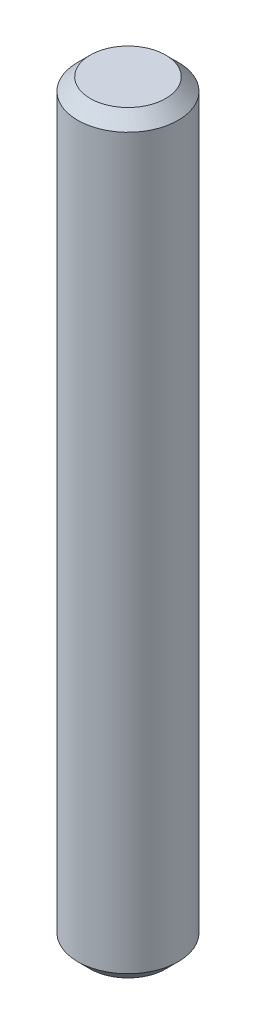
ISO-10303-21;
HEADER;
FILE_DESCRIPTION(('STEP AP214'),'2;1');
FILE_NAME('part.step','',(''),(''),'','','');
FILE_SCHEMA(('AUTOMOTIVE_DESIGN { 1 0 10303 214 1 1 1 1 }'));
ENDSEC;
DATA;
#1=APPLICATION_CONTEXT('core data for automotive mechanical design processes');
#2=APPLICATION_PROTOCOL_DEFINITION('international standard','automotive_design',2000,#1);
#3=PRODUCT_CONTEXT('',#1,'mechanical');
#4=PRODUCT('Part','Part','',(#3));
#5=PRODUCT_RELATED_PRODUCT_CATEGORY('part','',(#4));
#6=PRODUCT_DEFINITION_FORMATION('','',#4);
#7=PRODUCT_DEFINITION_CONTEXT('part definition',#1,'design');
#8=PRODUCT_DEFINITION('design','',#6,#7);
#9=PRODUCT_DEFINITION_SHAPE('','',#8);
#10=(LENGTH_UNIT() NAMED_UNIT(*) SI_UNIT(.MILLI.,.METRE.));
#11=(NAMED_UNIT(*) PLANE_ANGLE_UNIT() SI_UNIT($,.RADIAN.));
#12=(NAMED_UNIT(*) SI_UNIT($,.STERADIAN.) SOLID_ANGLE_UNIT());
#13=UNCERTAINTY_MEASURE_WITH_UNIT(LENGTH_MEASURE(1.E-05),#10,'distance_accuracy_value','');
#14=(GEOMETRIC_REPRESENTATION_CONTEXT(3) GLOBAL_UNCERTAINTY_ASSIGNED_CONTEXT((#13)) GLOBAL_UNIT_ASSIGNED_CONTEXT((#10,
#11,#12)) REPRESENTATION_CONTEXT('',''));
#15=CARTESIAN_POINT('',(0.,0.,0.));
#16=DIRECTION('',(0.,0.,1.));
#17=DIRECTION('',(1.,0.,0.));
#18=AXIS2_PLACEMENT_3D('',#15,#16,#17);
#19=CARTESIAN_POINT('',(0.,15.,0.));
#20=DIRECTION('',(0.,-1.,0.));
#21=DIRECTION('',(0.,0.,-1.));
#22=AXIS2_PLACEMENT_3D('',#19,#20,#21);
#23=CYLINDRICAL_SURFACE('',#22,2.);
#24=CARTESIAN_POINT('',(0.,-14.5,0.));
#25=DIRECTION('',(0.,1.,0.));
#26=DIRECTION('',(0.,0.,1.));
#27=AXIS2_PLACEMENT_3D('',#24,#25,#26);
#28=CIRCLE('',#27,2.);
#29=CARTESIAN_POINT('',(0.,-14.5,2.));
#30=VERTEX_POINT('',#29);
#31=EDGE_CURVE('E42',#30,#30,#28,.T.);
#32=ORIENTED_EDGE('',*,*,#31,.T.);
#33=EDGE_LOOP('',(#32));
#34=FACE_BOUND('',#33,.T.);
#35=CARTESIAN_POINT('',(0.,14.5,0.));
#36=DIRECTION('',(0.,1.,0.));
#37=DIRECTION('',(0.,0.,1.));
#38=AXIS2_PLACEMENT_3D('',#35,#36,#37);
#39=CIRCLE('',#38,2.);
#40=CARTESIAN_POINT('',(0.,14.5,2.));
#41=VERTEX_POINT('',#40);
#42=EDGE_CURVE('E46',#41,#41,#39,.F.);
#43=ORIENTED_EDGE('',*,*,#42,.T.);
#44=EDGE_LOOP('',(#43));
#45=FACE_BOUND('',#44,.T.);
#46=ADVANCED_FACE('F31',(#34,#45),#23,.T.);
#47=CARTESIAN_POINT('',(0.,15.,0.));
#48=DIRECTION('',(0.,1.,0.));
#49=DIRECTION('',(0.,0.,1.));
#50=AXIS2_PLACEMENT_3D('',#47,#48,#49);
#51=PLANE('',#50);
#52=CARTESIAN_POINT('',(0.,15.,0.));
#53=DIRECTION('',(0.,1.,0.));
#54=DIRECTION('',(0.,0.,1.));
#55=AXIS2_PLACEMENT_3D('',#52,#53,#54);
#56=CIRCLE('',#55,1.5);
#57=CARTESIAN_POINT('',(0.,15.,1.5));
#58=VERTEX_POINT('',#57);
#59=EDGE_CURVE('E10',#58,#58,#56,.T.);
#60=ORIENTED_EDGE('',*,*,#59,.T.);
#61=EDGE_LOOP('',(#60));
#62=FACE_BOUND('',#61,.T.);
#63=ADVANCED_FACE('F62',(#62),#51,.T.);
#64=CARTESIAN_POINT('',(0.,-15.,0.));
#65=DIRECTION('',(0.,1.,0.));
#66=DIRECTION('',(0.,0.,1.));
#67=AXIS2_PLACEMENT_3D('',#64,#65,#66);
#68=PLANE('',#67);
#69=CARTESIAN_POINT('',(0.,-15.,0.));
#70=DIRECTION('',(0.,1.,0.));
#71=DIRECTION('',(0.,0.,1.));
#72=AXIS2_PLACEMENT_3D('',#69,#70,#71);
#73=CIRCLE('',#72,1.5);
#74=CARTESIAN_POINT('',(0.,-15.,1.5));
#75=VERTEX_POINT('',#74);
#76=EDGE_CURVE('E38',#75,#75,#73,.F.);
#77=ORIENTED_EDGE('',*,*,#76,.T.);
#78=EDGE_LOOP('',(#77));
#79=FACE_BOUND('',#78,.T.);
#80=ADVANCED_FACE('F59',(#79),#68,.F.);
#81=CARTESIAN_POINT('',(0.,-14.5,0.));
#82=DIRECTION('',(0.,1.,0.));
#83=DIRECTION('',(0.,0.,1.));
#84=AXIS2_PLACEMENT_3D('',#81,#82,#83);
#85=CONICAL_SURFACE('',#84,2.,0.78539816339745);
#86=ORIENTED_EDGE('',*,*,#76,.F.);
#87=EDGE_LOOP('',(#86));
#88=FACE_BOUND('',#87,.T.);
#89=ORIENTED_EDGE('',*,*,#31,.F.);
#90=EDGE_LOOP('',(#89));
#91=FACE_BOUND('',#90,.T.);
#92=ADVANCED_FACE('F55',(#88,#91),#85,.T.);
#93=CARTESIAN_POINT('',(0.,15.,0.));
#94=DIRECTION('',(0.,-1.,0.));
#95=DIRECTION('',(0.,0.,-1.));
#96=AXIS2_PLACEMENT_3D('',#93,#94,#95);
#97=CONICAL_SURFACE('',#96,1.5,0.785398163397448);
#98=ORIENTED_EDGE('',*,*,#42,.F.);
#99=EDGE_LOOP('',(#98));
#100=FACE_BOUND('',#99,.T.);
#101=ORIENTED_EDGE('',*,*,#59,.F.);
#102=EDGE_LOOP('',(#101));
#103=FACE_BOUND('',#102,.T.);
#104=ADVANCED_FACE('F33',(#100,#103),#97,.T.);
#105=CLOSED_SHELL('',(#46,#63,#80,#92,#104));
#106=MANIFOLD_SOLID_BREP('B2',#105);
#107=ADVANCED_BREP_SHAPE_REPRESENTATION('',(#18,#106),#14);
#108=SHAPE_DEFINITION_REPRESENTATION(#9,#107);
ENDSEC;
END-ISO-10303-21;
